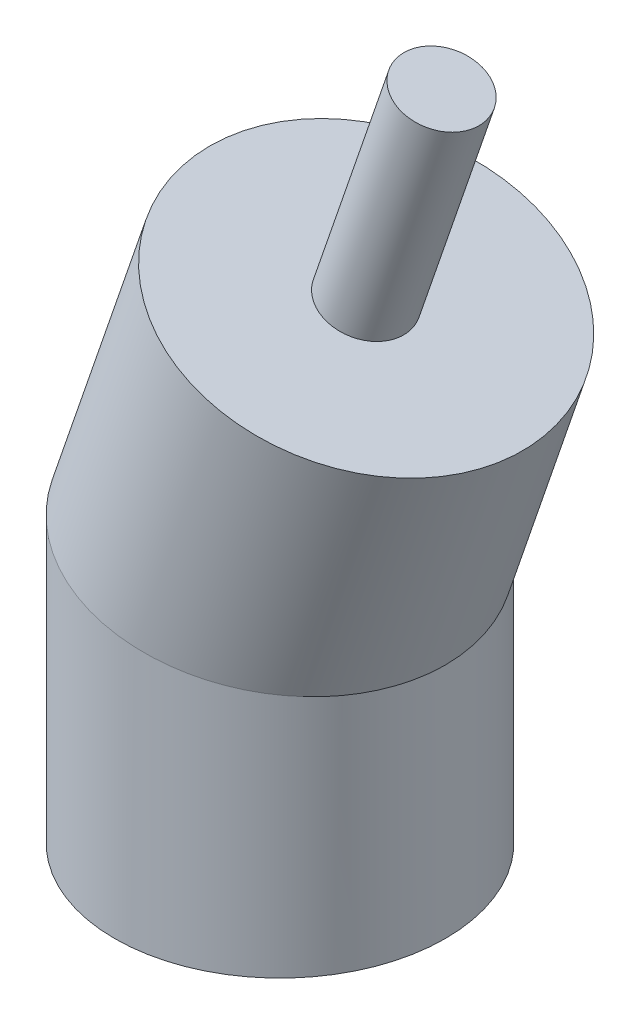
ISO-10303-21;
HEADER;
FILE_DESCRIPTION(('STEP AP214'),'2;1');
FILE_NAME('part.step','',(''),(''),'','','');
FILE_SCHEMA(('AUTOMOTIVE_DESIGN { 1 0 10303 214 1 1 1 1 }'));
ENDSEC;
DATA;
#1=APPLICATION_CONTEXT('core data for automotive mechanical design processes');
#2=APPLICATION_PROTOCOL_DEFINITION('international standard','automotive_design',2000,#1);
#3=PRODUCT_CONTEXT('',#1,'mechanical');
#4=PRODUCT('Part','Part','',(#3));
#5=PRODUCT_RELATED_PRODUCT_CATEGORY('part','',(#4));
#6=PRODUCT_DEFINITION_FORMATION('','',#4);
#7=PRODUCT_DEFINITION_CONTEXT('part definition',#1,'design');
#8=PRODUCT_DEFINITION('design','',#6,#7);
#9=PRODUCT_DEFINITION_SHAPE('','',#8);
#10=(LENGTH_UNIT() NAMED_UNIT(*) SI_UNIT(.MILLI.,.METRE.));
#11=(NAMED_UNIT(*) PLANE_ANGLE_UNIT() SI_UNIT($,.RADIAN.));
#12=(NAMED_UNIT(*) SI_UNIT($,.STERADIAN.) SOLID_ANGLE_UNIT());
#13=UNCERTAINTY_MEASURE_WITH_UNIT(LENGTH_MEASURE(1.E-05),#10,'distance_accuracy_value','');
#14=(GEOMETRIC_REPRESENTATION_CONTEXT(3) GLOBAL_UNCERTAINTY_ASSIGNED_CONTEXT((#13)) GLOBAL_UNIT_ASSIGNED_CONTEXT((#10,
#11,#12)) REPRESENTATION_CONTEXT('',''));
#15=CARTESIAN_POINT('',(0.,0.,0.));
#16=DIRECTION('',(0.,0.,1.));
#17=DIRECTION('',(1.,0.,0.));
#18=AXIS2_PLACEMENT_3D('',#15,#16,#17);
#19=CARTESIAN_POINT('',(0.,40.,0.));
#20=DIRECTION('',(0.325568154457157,0.945518575599317,0.));
#21=DIRECTION('',(-0.945518575599317,0.325568154457157,0.));
#22=AXIS2_PLACEMENT_3D('',#19,#20,#21);
#23=CYLINDRICAL_SURFACE('',#22,25.);
#24=CARTESIAN_POINT('',(0.,40.,0.));
#25=DIRECTION('',(0.165047605860678,0.986285601537231,0.));
#26=DIRECTION('',(0.986285601537232,-0.165047605860678,0.));
#27=AXIS2_PLACEMENT_3D('',#24,#25,#26);
#28=ELLIPSE('',#27,25.347627463115,25.);
#29=CARTESIAN_POINT('',(25.,35.8164347729645,0.));
#30=VERTEX_POINT('',#29);
#31=EDGE_CURVE('E40',#30,#30,#28,.T.);
#32=ORIENTED_EDGE('',*,*,#31,.T.);
#33=EDGE_LOOP('',(#32));
#34=FACE_BOUND('',#33,.T.);
#35=CARTESIAN_POINT('',(13.0227261782863,77.8207430239727,0.));
#36=DIRECTION('',(0.325568154457157,0.945518575599317,0.));
#37=DIRECTION('',(-0.945518575599317,0.325568154457157,0.));
#38=AXIS2_PLACEMENT_3D('',#35,#36,#37);
#39=CIRCLE('',#38,25.);
#40=CARTESIAN_POINT('',(-10.6152382116966,85.9599468854016,0.));
#41=VERTEX_POINT('',#40);
#42=EDGE_CURVE('E11',#41,#41,#39,.F.);
#43=ORIENTED_EDGE('',*,*,#42,.T.);
#44=EDGE_LOOP('',(#43));
#45=FACE_BOUND('',#44,.T.);
#46=ADVANCED_FACE('F34',(#34,#45),#23,.T.);
#47=CARTESIAN_POINT('',(0.,110.710678118655,0.));
#48=DIRECTION('',(0.,-1.,0.));
#49=DIRECTION('',(1.,0.,0.));
#50=AXIS2_PLACEMENT_3D('',#47,#48,#49);
#51=CYLINDRICAL_SURFACE('',#50,25.);
#52=CARTESIAN_POINT('',(0.,0.,0.));
#53=DIRECTION('',(0.,1.,0.));
#54=DIRECTION('',(0.,0.,1.));
#55=AXIS2_PLACEMENT_3D('',#52,#53,#54);
#56=CIRCLE('',#55,25.);
#57=CARTESIAN_POINT('',(0.,0.,25.));
#58=VERTEX_POINT('',#57);
#59=EDGE_CURVE('E44',#58,#58,#56,.T.);
#60=ORIENTED_EDGE('',*,*,#59,.T.);
#61=EDGE_LOOP('',(#60));
#62=FACE_BOUND('',#61,.T.);
#63=ORIENTED_EDGE('',*,*,#31,.F.);
#64=EDGE_LOOP('',(#63));
#65=FACE_BOUND('',#64,.T.);
#66=ADVANCED_FACE('F76',(#62,#65),#51,.T.);
#67=CARTESIAN_POINT('',(0.,0.,0.));
#68=DIRECTION('',(0.,1.,0.));
#69=DIRECTION('',(0.,0.,1.));
#70=AXIS2_PLACEMENT_3D('',#67,#68,#69);
#71=PLANE('',#70);
#72=CARTESIAN_POINT('',(0.,0.,0.));
#73=DIRECTION('',(0.,-1.,0.));
#74=DIRECTION('',(0.,0.,-1.));
#75=AXIS2_PLACEMENT_3D('',#72,#73,#74);
#76=CIRCLE('',#75,6.);
#77=CARTESIAN_POINT('',(0.,0.,-6.));
#78=VERTEX_POINT('',#77);
#79=EDGE_CURVE('E57',#78,#78,#76,.T.);
#80=ORIENTED_EDGE('',*,*,#79,.F.);
#81=EDGE_LOOP('',(#80));
#82=FACE_BOUND('',#81,.T.);
#83=ORIENTED_EDGE('',*,*,#59,.F.);
#84=EDGE_LOOP('',(#83));
#85=FACE_BOUND('',#84,.T.);
#86=ADVANCED_FACE('F72',(#82,#85),#71,.F.);
#87=CARTESIAN_POINT('',(13.0227261782863,77.8207430239727,0.));
#88=DIRECTION('',(0.325568154457157,0.945518575599317,0.));
#89=DIRECTION('',(-0.945518575599317,0.325568154457157,0.));
#90=AXIS2_PLACEMENT_3D('',#87,#88,#89);
#91=PLANE('',#90);
#92=CARTESIAN_POINT('',(13.0227261782863,77.8207430239727,0.));
#93=DIRECTION('',(0.325568154457157,0.945518575599317,0.));
#94=DIRECTION('',(-0.945518575599317,0.325568154457157,0.));
#95=AXIS2_PLACEMENT_3D('',#92,#93,#94);
#96=CIRCLE('',#95,6.);
#97=CARTESIAN_POINT('',(7.34961472469038,79.7741519507156,0.));
#98=VERTEX_POINT('',#97);
#99=EDGE_CURVE('E51',#98,#98,#96,.T.);
#100=ORIENTED_EDGE('',*,*,#99,.F.);
#101=EDGE_LOOP('',(#100));
#102=FACE_BOUND('',#101,.T.);
#103=ORIENTED_EDGE('',*,*,#42,.F.);
#104=EDGE_LOOP('',(#103));
#105=FACE_BOUND('',#104,.T.);
#106=ADVANCED_FACE('F75',(#102,#105),#91,.T.);
#107=CARTESIAN_POINT('',(24.4176115842868,110.913893169949,0.));
#108=DIRECTION('',(-0.325568154457157,-0.945518575599317,0.));
#109=DIRECTION('',(0.945518575599317,-0.325568154457157,0.));
#110=AXIS2_PLACEMENT_3D('',#107,#108,#109);
#111=CYLINDRICAL_SURFACE('',#110,6.);
#112=CARTESIAN_POINT('',(24.4176115842868,110.913893169949,0.));
#113=DIRECTION('',(0.325568154457157,0.945518575599317,0.));
#114=DIRECTION('',(-0.945518575599317,0.325568154457157,0.));
#115=AXIS2_PLACEMENT_3D('',#112,#113,#114);
#116=CIRCLE('',#115,6.);
#117=CARTESIAN_POINT('',(18.7445001306909,112.867302096692,0.));
#118=VERTEX_POINT('',#117);
#119=EDGE_CURVE('E48',#118,#118,#116,.T.);
#120=ORIENTED_EDGE('',*,*,#119,.F.);
#121=EDGE_LOOP('',(#120));
#122=FACE_BOUND('',#121,.T.);
#123=ORIENTED_EDGE('',*,*,#99,.T.);
#124=EDGE_LOOP('',(#123));
#125=FACE_BOUND('',#124,.T.);
#126=ADVANCED_FACE('F88',(#122,#125),#111,.T.);
#127=CARTESIAN_POINT('',(24.4176115842868,110.913893169949,0.));
#128=DIRECTION('',(0.325568154457157,0.945518575599317,0.));
#129=DIRECTION('',(-0.945518575599317,0.325568154457157,0.));
#130=AXIS2_PLACEMENT_3D('',#127,#128,#129);
#131=PLANE('',#130);
#132=ORIENTED_EDGE('',*,*,#119,.T.);
#133=EDGE_LOOP('',(#132));
#134=FACE_BOUND('',#133,.T.);
#135=ADVANCED_FACE('F68',(#134),#131,.T.);
#136=CARTESIAN_POINT('',(0.,20.,0.));
#137=DIRECTION('',(0.,-1.,0.));
#138=DIRECTION('',(0.,0.,-1.));
#139=AXIS2_PLACEMENT_3D('',#136,#137,#138);
#140=CYLINDRICAL_SURFACE('',#139,6.);
#141=CARTESIAN_POINT('',(0.,20.,0.));
#142=DIRECTION('',(0.,-1.,0.));
#143=DIRECTION('',(0.,0.,-1.));
#144=AXIS2_PLACEMENT_3D('',#141,#142,#143);
#145=CIRCLE('',#144,6.);
#146=CARTESIAN_POINT('',(0.,20.,-6.));
#147=VERTEX_POINT('',#146);
#148=EDGE_CURVE('E54',#147,#147,#145,.T.);
#149=ORIENTED_EDGE('',*,*,#148,.F.);
#150=EDGE_LOOP('',(#149));
#151=FACE_BOUND('',#150,.T.);
#152=ORIENTED_EDGE('',*,*,#79,.T.);
#153=EDGE_LOOP('',(#152));
#154=FACE_BOUND('',#153,.T.);
#155=ADVANCED_FACE('F65',(#151,#154),#140,.F.);
#156=CARTESIAN_POINT('',(0.,20.,0.));
#157=DIRECTION('',(0.,-1.,0.));
#158=DIRECTION('',(0.,0.,-1.));
#159=AXIS2_PLACEMENT_3D('',#156,#157,#158);
#160=PLANE('',#159);
#161=ORIENTED_EDGE('',*,*,#148,.T.);
#162=EDGE_LOOP('',(#161));
#163=FACE_BOUND('',#162,.T.);
#164=ADVANCED_FACE('F63',(#163),#160,.T.);
#165=CLOSED_SHELL('',(#46,#66,#86,#106,#126,#135,#155,#164));
#166=MANIFOLD_SOLID_BREP('B2',#165);
#167=ADVANCED_BREP_SHAPE_REPRESENTATION('',(#18,#166),#14);
#168=SHAPE_DEFINITION_REPRESENTATION(#9,#167);
ENDSEC;
END-ISO-10303-21;
